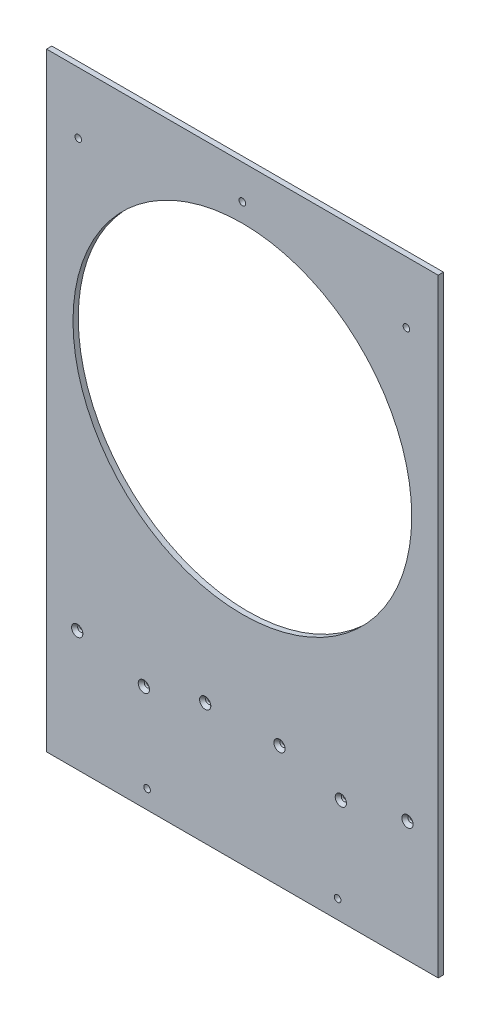
ISO-10303-21;
HEADER;
FILE_DESCRIPTION(('STEP AP214'),'2;1');
FILE_NAME('part.step','',(''),(''),'','','');
FILE_SCHEMA(('AUTOMOTIVE_DESIGN { 1 0 10303 214 1 1 1 1 }'));
ENDSEC;
DATA;
#1=APPLICATION_CONTEXT('core data for automotive mechanical design processes');
#2=APPLICATION_PROTOCOL_DEFINITION('international standard','automotive_design',2000,#1);
#3=PRODUCT_CONTEXT('',#1,'mechanical');
#4=PRODUCT('Part','Part','',(#3));
#5=PRODUCT_RELATED_PRODUCT_CATEGORY('part','',(#4));
#6=PRODUCT_DEFINITION_FORMATION('','',#4);
#7=PRODUCT_DEFINITION_CONTEXT('part definition',#1,'design');
#8=PRODUCT_DEFINITION('design','',#6,#7);
#9=PRODUCT_DEFINITION_SHAPE('','',#8);
#10=(LENGTH_UNIT() NAMED_UNIT(*) SI_UNIT(.MILLI.,.METRE.));
#11=(NAMED_UNIT(*) PLANE_ANGLE_UNIT() SI_UNIT($,.RADIAN.));
#12=(NAMED_UNIT(*) SI_UNIT($,.STERADIAN.) SOLID_ANGLE_UNIT());
#13=UNCERTAINTY_MEASURE_WITH_UNIT(LENGTH_MEASURE(1.E-05),#10,'distance_accuracy_value','');
#14=(GEOMETRIC_REPRESENTATION_CONTEXT(3) GLOBAL_UNCERTAINTY_ASSIGNED_CONTEXT((#13)) GLOBAL_UNIT_ASSIGNED_CONTEXT((#10,
#11,#12)) REPRESENTATION_CONTEXT('',''));
#15=CARTESIAN_POINT('',(0.,0.,0.));
#16=DIRECTION('',(0.,0.,1.));
#17=DIRECTION('',(1.,0.,0.));
#18=AXIS2_PLACEMENT_3D('',#15,#16,#17);
#19=CARTESIAN_POINT('',(0.,0.,6.35));
#20=DIRECTION('',(0.,0.,-1.));
#21=DIRECTION('',(-1.,0.,0.));
#22=AXIS2_PLACEMENT_3D('',#19,#20,#21);
#23=PLANE('',#22);
#24=CARTESIAN_POINT('',(-114.300000000005,1677.035,6.35));
#25=DIRECTION('',(0.,0.,1.));
#26=DIRECTION('',(1.,0.,0.));
#27=AXIS2_PLACEMENT_3D('',#24,#25,#26);
#28=CIRCLE('',#27,3.96874999999999);
#29=CARTESIAN_POINT('',(-110.331250000005,1677.035,6.35));
#30=VERTEX_POINT('',#29);
#31=EDGE_CURVE('E185',#30,#30,#28,.T.);
#32=ORIENTED_EDGE('',*,*,#31,.F.);
#33=EDGE_LOOP('',(#32));
#34=FACE_BOUND('',#33,.T.);
#35=CARTESIAN_POINT('',(114.299999999995,1677.035,6.35));
#36=DIRECTION('',(0.,0.,1.));
#37=DIRECTION('',(1.,0.,0.));
#38=AXIS2_PLACEMENT_3D('',#35,#36,#37);
#39=CIRCLE('',#38,3.96874999999999);
#40=CARTESIAN_POINT('',(118.268749999995,1677.035,6.35));
#41=VERTEX_POINT('',#40);
#42=EDGE_CURVE('E179',#41,#41,#39,.T.);
#43=ORIENTED_EDGE('',*,*,#42,.F.);
#44=EDGE_LOOP('',(#43));
#45=FACE_BOUND('',#44,.T.);
#46=CARTESIAN_POINT('',(-196.850000000007,2311.4,6.35));
#47=DIRECTION('',(0.,0.,1.));
#48=DIRECTION('',(1.,0.,0.));
#49=AXIS2_PLACEMENT_3D('',#46,#47,#48);
#50=CIRCLE('',#49,3.96874999999999);
#51=CARTESIAN_POINT('',(-192.881250000007,2311.4,6.35));
#52=VERTEX_POINT('',#51);
#53=EDGE_CURVE('E173',#52,#52,#50,.T.);
#54=ORIENTED_EDGE('',*,*,#53,.F.);
#55=EDGE_LOOP('',(#54));
#56=FACE_BOUND('',#55,.T.);
#57=CARTESIAN_POINT('',(196.849999999993,2311.4,6.35));
#58=DIRECTION('',(0.,0.,1.));
#59=DIRECTION('',(1.,0.,0.));
#60=AXIS2_PLACEMENT_3D('',#57,#58,#59);
#61=CIRCLE('',#60,3.96874999999999);
#62=CARTESIAN_POINT('',(200.818749999993,2311.4,6.35));
#63=VERTEX_POINT('',#62);
#64=EDGE_CURVE('E167',#63,#63,#61,.T.);
#65=ORIENTED_EDGE('',*,*,#64,.F.);
#66=EDGE_LOOP('',(#65));
#67=FACE_BOUND('',#66,.T.);
#68=CARTESIAN_POINT('',(44.5712711724056,1800.94515264691,6.35));
#69=DIRECTION('',(0.,0.,1.));
#70=DIRECTION('',(1.,0.,0.));
#71=AXIS2_PLACEMENT_3D('',#68,#69,#70);
#72=CIRCLE('',#71,6.7437);
#73=CARTESIAN_POINT('',(51.3149711724056,1800.94515264691,6.35));
#74=VERTEX_POINT('',#73);
#75=EDGE_CURVE('E155',#74,#74,#72,.T.);
#76=ORIENTED_EDGE('',*,*,#75,.F.);
#77=EDGE_LOOP('',(#76));
#78=FACE_BOUND('',#77,.T.);
#79=CARTESIAN_POINT('',(118.174819135633,1781.2231414101,6.35));
#80=DIRECTION('',(0.,0.,1.));
#81=DIRECTION('',(1.,0.,0.));
#82=AXIS2_PLACEMENT_3D('',#79,#80,#81);
#83=CIRCLE('',#82,6.7437);
#84=CARTESIAN_POINT('',(124.918519135633,1781.2231414101,6.35));
#85=VERTEX_POINT('',#84);
#86=EDGE_CURVE('E146',#85,#85,#83,.T.);
#87=ORIENTED_EDGE('',*,*,#86,.F.);
#88=EDGE_LOOP('',(#87));
#89=FACE_BOUND('',#88,.T.);
#90=CARTESIAN_POINT('',(-44.5712711724155,1800.94515264691,6.35));
#91=DIRECTION('',(0.,0.,1.));
#92=DIRECTION('',(1.,0.,0.));
#93=AXIS2_PLACEMENT_3D('',#90,#91,#92);
#94=CIRCLE('',#93,6.7437);
#95=CARTESIAN_POINT('',(-37.8275711724155,1800.94515264691,6.35));
#96=VERTEX_POINT('',#95);
#97=EDGE_CURVE('E137',#96,#96,#94,.T.);
#98=ORIENTED_EDGE('',*,*,#97,.F.);
#99=EDGE_LOOP('',(#98));
#100=FACE_BOUND('',#99,.T.);
#101=CARTESIAN_POINT('',(-118.174819135643,1781.2231414101,6.35));
#102=DIRECTION('',(0.,0.,1.));
#103=DIRECTION('',(1.,0.,0.));
#104=AXIS2_PLACEMENT_3D('',#101,#102,#103);
#105=CIRCLE('',#104,6.7437);
#106=CARTESIAN_POINT('',(-111.431119135643,1781.2231414101,6.35));
#107=VERTEX_POINT('',#106);
#108=EDGE_CURVE('E128',#107,#107,#105,.T.);
#109=ORIENTED_EDGE('',*,*,#108,.F.);
#110=EDGE_LOOP('',(#109));
#111=FACE_BOUND('',#110,.T.);
#112=CARTESIAN_POINT('',(-198.120000000005,1799.24591723236,6.35));
#113=DIRECTION('',(0.,0.,1.));
#114=DIRECTION('',(1.,0.,0.));
#115=AXIS2_PLACEMENT_3D('',#112,#113,#114);
#116=CIRCLE('',#115,6.74369999999999);
#117=CARTESIAN_POINT('',(-191.376300000005,1799.24591723236,6.35));
#118=VERTEX_POINT('',#117);
#119=EDGE_CURVE('E119',#118,#118,#116,.T.);
#120=ORIENTED_EDGE('',*,*,#119,.F.);
#121=EDGE_LOOP('',(#120));
#122=FACE_BOUND('',#121,.T.);
#123=CARTESIAN_POINT('',(198.120000000005,1799.24591723236,6.35));
#124=DIRECTION('',(0.,0.,1.));
#125=DIRECTION('',(1.,0.,0.));
#126=AXIS2_PLACEMENT_3D('',#123,#124,#125);
#127=CIRCLE('',#126,6.74369999999999);
#128=CARTESIAN_POINT('',(204.863700000005,1799.24591723236,6.35));
#129=VERTEX_POINT('',#128);
#130=EDGE_CURVE('E110',#129,#129,#127,.T.);
#131=ORIENTED_EDGE('',*,*,#130,.F.);
#132=EDGE_LOOP('',(#131));
#133=FACE_BOUND('',#132,.T.);
#134=DIRECTION('',(0.,1.,0.));
#135=VECTOR('',#134,1.);
#136=CARTESIAN_POINT('',(234.95,0.,6.35));
#137=LINE('',#136,#135);
#138=CARTESIAN_POINT('',(234.95,1654.81,6.35));
#139=VERTEX_POINT('',#138);
#140=CARTESIAN_POINT('',(234.95,2385.06,6.35));
#141=VERTEX_POINT('',#140);
#142=EDGE_CURVE('E11',#139,#141,#137,.T.);
#143=ORIENTED_EDGE('',*,*,#142,.T.);
#144=DIRECTION('',(1.,0.,0.));
#145=VECTOR('',#144,1.);
#146=CARTESIAN_POINT('',(-234.95,2385.06,6.35));
#147=LINE('',#146,#145);
#148=CARTESIAN_POINT('',(-234.95,2385.06,6.35));
#149=VERTEX_POINT('',#148);
#150=EDGE_CURVE('E51',#149,#141,#147,.T.);
#151=ORIENTED_EDGE('',*,*,#150,.F.);
#152=DIRECTION('',(0.,-1.,0.));
#153=VECTOR('',#152,1.);
#154=CARTESIAN_POINT('',(-234.95,0.,6.35));
#155=LINE('',#154,#153);
#156=CARTESIAN_POINT('',(-234.95,1654.81,6.35));
#157=VERTEX_POINT('',#156);
#158=EDGE_CURVE('E43',#149,#157,#155,.T.);
#159=ORIENTED_EDGE('',*,*,#158,.T.);
#160=DIRECTION('',(-1.,0.,0.));
#161=VECTOR('',#160,1.);
#162=CARTESIAN_POINT('',(-234.95,1654.81,6.35));
#163=LINE('',#162,#161);
#164=EDGE_CURVE('E191',#139,#157,#163,.T.);
#165=ORIENTED_EDGE('',*,*,#164,.F.);
#166=EDGE_LOOP('',(#143,#151,#159,#165));
#167=FACE_BOUND('',#166,.T.);
#168=CARTESIAN_POINT('',(-4.96628305637047E-12,2118.36,6.35));
#169=DIRECTION('',(0.,0.,1.));
#170=DIRECTION('',(1.,0.,0.));
#171=AXIS2_PLACEMENT_3D('',#168,#169,#170);
#172=CIRCLE('',#171,203.2);
#173=CARTESIAN_POINT('',(203.199999999995,2118.36,6.35));
#174=VERTEX_POINT('',#173);
#175=EDGE_CURVE('E95',#174,#174,#172,.T.);
#176=ORIENTED_EDGE('',*,*,#175,.F.);
#177=EDGE_LOOP('',(#176));
#178=FACE_BOUND('',#177,.T.);
#179=CARTESIAN_POINT('',(0.,2343.785,6.35));
#180=DIRECTION('',(0.,0.,1.));
#181=DIRECTION('',(1.,0.,0.));
#182=AXIS2_PLACEMENT_3D('',#179,#180,#181);
#183=CIRCLE('',#182,3.96875);
#184=CARTESIAN_POINT('',(3.96875,2343.785,6.35));
#185=VERTEX_POINT('',#184);
#186=EDGE_CURVE('E161',#185,#185,#183,.T.);
#187=ORIENTED_EDGE('',*,*,#186,.F.);
#188=EDGE_LOOP('',(#187));
#189=FACE_BOUND('',#188,.T.);
#190=ADVANCED_FACE('F34',(#34,#45,#56,#67,#78,#89,#100,#111,#122,#133,#167,#178,#189),#23,.F.);
#191=CARTESIAN_POINT('',(0.,0.,0.));
#192=DIRECTION('',(0.,0.,-1.));
#193=DIRECTION('',(-1.,0.,0.));
#194=AXIS2_PLACEMENT_3D('',#191,#192,#193);
#195=PLANE('',#194);
#196=DIRECTION('',(1.,0.,0.));
#197=VECTOR('',#196,1.);
#198=CARTESIAN_POINT('',(-234.95,2385.06,0.));
#199=LINE('',#198,#197);
#200=CARTESIAN_POINT('',(-234.95,2385.06,0.));
#201=VERTEX_POINT('',#200);
#202=CARTESIAN_POINT('',(234.95,2385.06,0.));
#203=VERTEX_POINT('',#202);
#204=EDGE_CURVE('E78',#201,#203,#199,.T.);
#205=ORIENTED_EDGE('',*,*,#204,.T.);
#206=DIRECTION('',(0.,1.,0.));
#207=VECTOR('',#206,1.);
#208=CARTESIAN_POINT('',(234.95,0.,0.));
#209=LINE('',#208,#207);
#210=CARTESIAN_POINT('',(234.95,1654.81,0.));
#211=VERTEX_POINT('',#210);
#212=EDGE_CURVE('E38',#211,#203,#209,.T.);
#213=ORIENTED_EDGE('',*,*,#212,.F.);
#214=DIRECTION('',(-1.,0.,0.));
#215=VECTOR('',#214,1.);
#216=CARTESIAN_POINT('',(-234.95,1654.81,0.));
#217=LINE('',#216,#215);
#218=CARTESIAN_POINT('',(-234.95,1654.81,0.));
#219=VERTEX_POINT('',#218);
#220=EDGE_CURVE('E59',#211,#219,#217,.T.);
#221=ORIENTED_EDGE('',*,*,#220,.T.);
#222=DIRECTION('',(0.,-1.,0.));
#223=VECTOR('',#222,1.);
#224=CARTESIAN_POINT('',(-234.95,0.,0.));
#225=LINE('',#224,#223);
#226=EDGE_CURVE('E90',#201,#219,#225,.T.);
#227=ORIENTED_EDGE('',*,*,#226,.F.);
#228=EDGE_LOOP('',(#205,#213,#221,#227));
#229=FACE_BOUND('',#228,.T.);
#230=CARTESIAN_POINT('',(-114.300000000005,1677.035,0.));
#231=DIRECTION('',(0.,0.,1.));
#232=DIRECTION('',(1.,0.,0.));
#233=AXIS2_PLACEMENT_3D('',#230,#231,#232);
#234=CIRCLE('',#233,3.96874999999999);
#235=CARTESIAN_POINT('',(-110.331250000005,1677.035,0.));
#236=VERTEX_POINT('',#235);
#237=EDGE_CURVE('E182',#236,#236,#234,.T.);
#238=ORIENTED_EDGE('',*,*,#237,.T.);
#239=EDGE_LOOP('',(#238));
#240=FACE_BOUND('',#239,.T.);
#241=CARTESIAN_POINT('',(114.299999999995,1677.035,0.));
#242=DIRECTION('',(0.,0.,1.));
#243=DIRECTION('',(1.,0.,0.));
#244=AXIS2_PLACEMENT_3D('',#241,#242,#243);
#245=CIRCLE('',#244,3.96874999999999);
#246=CARTESIAN_POINT('',(118.268749999995,1677.035,0.));
#247=VERTEX_POINT('',#246);
#248=EDGE_CURVE('E176',#247,#247,#245,.T.);
#249=ORIENTED_EDGE('',*,*,#248,.T.);
#250=EDGE_LOOP('',(#249));
#251=FACE_BOUND('',#250,.T.);
#252=CARTESIAN_POINT('',(-196.850000000007,2311.4,0.));
#253=DIRECTION('',(0.,0.,1.));
#254=DIRECTION('',(1.,0.,0.));
#255=AXIS2_PLACEMENT_3D('',#252,#253,#254);
#256=CIRCLE('',#255,3.96874999999999);
#257=CARTESIAN_POINT('',(-192.881250000007,2311.4,0.));
#258=VERTEX_POINT('',#257);
#259=EDGE_CURVE('E170',#258,#258,#256,.T.);
#260=ORIENTED_EDGE('',*,*,#259,.T.);
#261=EDGE_LOOP('',(#260));
#262=FACE_BOUND('',#261,.T.);
#263=CARTESIAN_POINT('',(196.849999999993,2311.4,0.));
#264=DIRECTION('',(0.,0.,1.));
#265=DIRECTION('',(1.,0.,0.));
#266=AXIS2_PLACEMENT_3D('',#263,#264,#265);
#267=CIRCLE('',#266,3.96874999999999);
#268=CARTESIAN_POINT('',(200.818749999993,2311.4,0.));
#269=VERTEX_POINT('',#268);
#270=EDGE_CURVE('E164',#269,#269,#267,.T.);
#271=ORIENTED_EDGE('',*,*,#270,.T.);
#272=EDGE_LOOP('',(#271));
#273=FACE_BOUND('',#272,.T.);
#274=CARTESIAN_POINT('',(0.,2343.785,0.));
#275=DIRECTION('',(0.,0.,1.));
#276=DIRECTION('',(1.,0.,0.));
#277=AXIS2_PLACEMENT_3D('',#274,#275,#276);
#278=CIRCLE('',#277,3.96875);
#279=CARTESIAN_POINT('',(3.96875,2343.785,0.));
#280=VERTEX_POINT('',#279);
#281=EDGE_CURVE('E158',#280,#280,#278,.T.);
#282=ORIENTED_EDGE('',*,*,#281,.T.);
#283=EDGE_LOOP('',(#282));
#284=FACE_BOUND('',#283,.T.);
#285=CARTESIAN_POINT('',(-4.96628305637047E-12,2118.36,0.));
#286=DIRECTION('',(0.,0.,1.));
#287=DIRECTION('',(1.,0.,0.));
#288=AXIS2_PLACEMENT_3D('',#285,#286,#287);
#289=CIRCLE('',#288,203.2);
#290=CARTESIAN_POINT('',(203.199999999995,2118.36,0.));
#291=VERTEX_POINT('',#290);
#292=EDGE_CURVE('E99',#291,#291,#289,.T.);
#293=ORIENTED_EDGE('',*,*,#292,.T.);
#294=EDGE_LOOP('',(#293));
#295=FACE_BOUND('',#294,.T.);
#296=CARTESIAN_POINT('',(198.120000000005,1799.24591723236,0.));
#297=DIRECTION('',(0.,0.,1.));
#298=DIRECTION('',(1.,0.,0.));
#299=AXIS2_PLACEMENT_3D('',#296,#297,#298);
#300=CIRCLE('',#299,3.3782);
#301=CARTESIAN_POINT('',(201.498200000005,1799.24591723236,0.));
#302=VERTEX_POINT('',#301);
#303=EDGE_CURVE('E103',#302,#302,#300,.T.);
#304=ORIENTED_EDGE('',*,*,#303,.T.);
#305=EDGE_LOOP('',(#304));
#306=FACE_BOUND('',#305,.T.);
#307=CARTESIAN_POINT('',(-198.120000000005,1799.24591723236,0.));
#308=DIRECTION('',(0.,0.,1.));
#309=DIRECTION('',(1.,0.,0.));
#310=AXIS2_PLACEMENT_3D('',#307,#308,#309);
#311=CIRCLE('',#310,3.3782);
#312=CARTESIAN_POINT('',(-194.741800000005,1799.24591723236,0.));
#313=VERTEX_POINT('',#312);
#314=EDGE_CURVE('E113',#313,#313,#311,.T.);
#315=ORIENTED_EDGE('',*,*,#314,.T.);
#316=EDGE_LOOP('',(#315));
#317=FACE_BOUND('',#316,.T.);
#318=CARTESIAN_POINT('',(-118.174819135643,1781.2231414101,0.));
#319=DIRECTION('',(0.,0.,1.));
#320=DIRECTION('',(1.,0.,0.));
#321=AXIS2_PLACEMENT_3D('',#318,#319,#320);
#322=CIRCLE('',#321,3.37819999999998);
#323=CARTESIAN_POINT('',(-114.796619135643,1781.2231414101,0.));
#324=VERTEX_POINT('',#323);
#325=EDGE_CURVE('E122',#324,#324,#322,.T.);
#326=ORIENTED_EDGE('',*,*,#325,.T.);
#327=EDGE_LOOP('',(#326));
#328=FACE_BOUND('',#327,.T.);
#329=CARTESIAN_POINT('',(-44.5712711724155,1800.94515264691,0.));
#330=DIRECTION('',(0.,0.,1.));
#331=DIRECTION('',(1.,0.,0.));
#332=AXIS2_PLACEMENT_3D('',#329,#330,#331);
#333=CIRCLE('',#332,3.37819999999999);
#334=CARTESIAN_POINT('',(-41.1930711724155,1800.94515264691,0.));
#335=VERTEX_POINT('',#334);
#336=EDGE_CURVE('E131',#335,#335,#333,.T.);
#337=ORIENTED_EDGE('',*,*,#336,.T.);
#338=EDGE_LOOP('',(#337));
#339=FACE_BOUND('',#338,.T.);
#340=CARTESIAN_POINT('',(118.174819135633,1781.2231414101,0.));
#341=DIRECTION('',(0.,0.,1.));
#342=DIRECTION('',(1.,0.,0.));
#343=AXIS2_PLACEMENT_3D('',#340,#341,#342);
#344=CIRCLE('',#343,3.37819999999998);
#345=CARTESIAN_POINT('',(121.553019135633,1781.2231414101,0.));
#346=VERTEX_POINT('',#345);
#347=EDGE_CURVE('E140',#346,#346,#344,.T.);
#348=ORIENTED_EDGE('',*,*,#347,.T.);
#349=EDGE_LOOP('',(#348));
#350=FACE_BOUND('',#349,.T.);
#351=CARTESIAN_POINT('',(44.5712711724056,1800.94515264691,0.));
#352=DIRECTION('',(0.,0.,1.));
#353=DIRECTION('',(1.,0.,0.));
#354=AXIS2_PLACEMENT_3D('',#351,#352,#353);
#355=CIRCLE('',#354,3.37819999999999);
#356=CARTESIAN_POINT('',(47.9494711724056,1800.94515264691,0.));
#357=VERTEX_POINT('',#356);
#358=EDGE_CURVE('E149',#357,#357,#355,.T.);
#359=ORIENTED_EDGE('',*,*,#358,.T.);
#360=EDGE_LOOP('',(#359));
#361=FACE_BOUND('',#360,.T.);
#362=ADVANCED_FACE('F88',(#229,#240,#251,#262,#273,#284,#295,#306,#317,#328,#339,#350,#361),
#195,.T.);
#363=CARTESIAN_POINT('',(-234.95,0.,6.35));
#364=DIRECTION('',(1.,0.,0.));
#365=DIRECTION('',(0.,0.,-1.));
#366=AXIS2_PLACEMENT_3D('',#363,#364,#365);
#367=PLANE('',#366);
#368=ORIENTED_EDGE('',*,*,#158,.F.);
#369=DIRECTION('',(0.,0.,1.));
#370=VECTOR('',#369,1.);
#371=CARTESIAN_POINT('',(-234.95,2385.06,0.));
#372=LINE('',#371,#370);
#373=EDGE_CURVE('E83',#201,#149,#372,.T.);
#374=ORIENTED_EDGE('',*,*,#373,.F.);
#375=ORIENTED_EDGE('',*,*,#226,.T.);
#376=DIRECTION('',(0.,0.,1.));
#377=VECTOR('',#376,1.);
#378=CARTESIAN_POINT('',(-234.95,1654.81,0.));
#379=LINE('',#378,#377);
#380=EDGE_CURVE('E188',#219,#157,#379,.T.);
#381=ORIENTED_EDGE('',*,*,#380,.T.);
#382=EDGE_LOOP('',(#368,#374,#375,#381));
#383=FACE_BOUND('',#382,.T.);
#384=ADVANCED_FACE('F36',(#383),#367,.F.);
#385=CARTESIAN_POINT('',(234.95,0.,6.35));
#386=DIRECTION('',(-1.,0.,0.));
#387=DIRECTION('',(0.,0.,1.));
#388=AXIS2_PLACEMENT_3D('',#385,#386,#387);
#389=PLANE('',#388);
#390=ORIENTED_EDGE('',*,*,#212,.T.);
#391=DIRECTION('',(0.,0.,1.));
#392=VECTOR('',#391,1.);
#393=CARTESIAN_POINT('',(234.95,2385.06,0.));
#394=LINE('',#393,#392);
#395=EDGE_CURVE('E75',#203,#141,#394,.T.);
#396=ORIENTED_EDGE('',*,*,#395,.T.);
#397=ORIENTED_EDGE('',*,*,#142,.F.);
#398=DIRECTION('',(0.,0.,1.));
#399=VECTOR('',#398,1.);
#400=CARTESIAN_POINT('',(234.95,1654.81,0.));
#401=LINE('',#400,#399);
#402=EDGE_CURVE('E93',#211,#139,#401,.T.);
#403=ORIENTED_EDGE('',*,*,#402,.F.);
#404=EDGE_LOOP('',(#390,#396,#397,#403));
#405=FACE_BOUND('',#404,.T.);
#406=ADVANCED_FACE('F92',(#405),#389,.F.);
#407=CARTESIAN_POINT('',(-4.96628305637047E-12,2118.36,6.35));
#408=DIRECTION('',(0.,0.,-1.));
#409=DIRECTION('',(-1.,0.,0.));
#410=AXIS2_PLACEMENT_3D('',#407,#408,#409);
#411=CYLINDRICAL_SURFACE('',#410,203.2);
#412=ORIENTED_EDGE('',*,*,#175,.T.);
#413=EDGE_LOOP('',(#412));
#414=FACE_BOUND('',#413,.T.);
#415=ORIENTED_EDGE('',*,*,#292,.F.);
#416=EDGE_LOOP('',(#415));
#417=FACE_BOUND('',#416,.T.);
#418=ADVANCED_FACE('F222',(#414,#417),#411,.F.);
#419=CARTESIAN_POINT('',(198.120000000005,1799.24591723236,6.35));
#420=DIRECTION('',(0.,0.,1.));
#421=DIRECTION('',(1.,0.,0.));
#422=AXIS2_PLACEMENT_3D('',#419,#420,#421);
#423=CYLINDRICAL_SURFACE('',#422,3.3782);
#424=ORIENTED_EDGE('',*,*,#303,.F.);
#425=EDGE_LOOP('',(#424));
#426=FACE_BOUND('',#425,.T.);
#427=CARTESIAN_POINT('',(198.120000000005,1799.24591723236,2.4784351254977));
#428=DIRECTION('',(0.,0.,1.));
#429=DIRECTION('',(1.,0.,0.));
#430=AXIS2_PLACEMENT_3D('',#427,#428,#429);
#431=CIRCLE('',#430,3.3782);
#432=CARTESIAN_POINT('',(201.498200000005,1799.24591723236,2.4784351254977));
#433=VERTEX_POINT('',#432);
#434=EDGE_CURVE('E107',#433,#433,#431,.T.);
#435=ORIENTED_EDGE('',*,*,#434,.T.);
#436=EDGE_LOOP('',(#435));
#437=FACE_BOUND('',#436,.T.);
#438=ADVANCED_FACE('F229',(#426,#437),#423,.F.);
#439=CARTESIAN_POINT('',(198.120000000005,1799.24591723236,6.35));
#440=DIRECTION('',(0.,0.,1.));
#441=DIRECTION('',(1.,0.,0.));
#442=AXIS2_PLACEMENT_3D('',#439,#440,#441);
#443=CONICAL_SURFACE('',#442,6.74369999999999,0.715584993317675);
#444=ORIENTED_EDGE('',*,*,#434,.F.);
#445=EDGE_LOOP('',(#444));
#446=FACE_BOUND('',#445,.T.);
#447=ORIENTED_EDGE('',*,*,#130,.T.);
#448=EDGE_LOOP('',(#447));
#449=FACE_BOUND('',#448,.T.);
#450=ADVANCED_FACE('F395',(#446,#449),#443,.F.);
#451=CARTESIAN_POINT('',(-198.120000000005,1799.24591723236,6.35));
#452=DIRECTION('',(0.,0.,1.));
#453=DIRECTION('',(1.,0.,0.));
#454=AXIS2_PLACEMENT_3D('',#451,#452,#453);
#455=CYLINDRICAL_SURFACE('',#454,3.3782);
#456=ORIENTED_EDGE('',*,*,#314,.F.);
#457=EDGE_LOOP('',(#456));
#458=FACE_BOUND('',#457,.T.);
#459=CARTESIAN_POINT('',(-198.120000000005,1799.24591723236,2.4784351254977));
#460=DIRECTION('',(0.,0.,1.));
#461=DIRECTION('',(1.,0.,0.));
#462=AXIS2_PLACEMENT_3D('',#459,#460,#461);
#463=CIRCLE('',#462,3.3782);
#464=CARTESIAN_POINT('',(-194.741800000005,1799.24591723236,2.4784351254977));
#465=VERTEX_POINT('',#464);
#466=EDGE_CURVE('E116',#465,#465,#463,.T.);
#467=ORIENTED_EDGE('',*,*,#466,.T.);
#468=EDGE_LOOP('',(#467));
#469=FACE_BOUND('',#468,.T.);
#470=ADVANCED_FACE('F385',(#458,#469),#455,.F.);
#471=CARTESIAN_POINT('',(-198.120000000005,1799.24591723236,6.35));
#472=DIRECTION('',(0.,0.,1.));
#473=DIRECTION('',(1.,0.,0.));
#474=AXIS2_PLACEMENT_3D('',#471,#472,#473);
#475=CONICAL_SURFACE('',#474,6.74369999999999,0.715584993317675);
#476=ORIENTED_EDGE('',*,*,#466,.F.);
#477=EDGE_LOOP('',(#476));
#478=FACE_BOUND('',#477,.T.);
#479=ORIENTED_EDGE('',*,*,#119,.T.);
#480=EDGE_LOOP('',(#479));
#481=FACE_BOUND('',#480,.T.);
#482=ADVANCED_FACE('F375',(#478,#481),#475,.F.);
#483=CARTESIAN_POINT('',(-118.174819135643,1781.2231414101,6.35));
#484=DIRECTION('',(0.,0.,1.));
#485=DIRECTION('',(1.,0.,0.));
#486=AXIS2_PLACEMENT_3D('',#483,#484,#485);
#487=CYLINDRICAL_SURFACE('',#486,3.37819999999999);
#488=ORIENTED_EDGE('',*,*,#325,.F.);
#489=EDGE_LOOP('',(#488));
#490=FACE_BOUND('',#489,.T.);
#491=CARTESIAN_POINT('',(-118.174819135643,1781.2231414101,2.4784351254977));
#492=DIRECTION('',(0.,0.,1.));
#493=DIRECTION('',(1.,0.,0.));
#494=AXIS2_PLACEMENT_3D('',#491,#492,#493);
#495=CIRCLE('',#494,3.3782);
#496=CARTESIAN_POINT('',(-114.796619135643,1781.2231414101,2.4784351254977));
#497=VERTEX_POINT('',#496);
#498=EDGE_CURVE('E125',#497,#497,#495,.T.);
#499=ORIENTED_EDGE('',*,*,#498,.T.);
#500=EDGE_LOOP('',(#499));
#501=FACE_BOUND('',#500,.T.);
#502=ADVANCED_FACE('F365',(#490,#501),#487,.F.);
#503=CARTESIAN_POINT('',(-118.174819135643,1781.2231414101,6.35));
#504=DIRECTION('',(0.,0.,1.));
#505=DIRECTION('',(1.,0.,0.));
#506=AXIS2_PLACEMENT_3D('',#503,#504,#505);
#507=CONICAL_SURFACE('',#506,6.7437,0.715584993317677);
#508=ORIENTED_EDGE('',*,*,#498,.F.);
#509=EDGE_LOOP('',(#508));
#510=FACE_BOUND('',#509,.T.);
#511=ORIENTED_EDGE('',*,*,#108,.T.);
#512=EDGE_LOOP('',(#511));
#513=FACE_BOUND('',#512,.T.);
#514=ADVANCED_FACE('F355',(#510,#513),#507,.F.);
#515=CARTESIAN_POINT('',(-44.5712711724155,1800.94515264691,6.35));
#516=DIRECTION('',(0.,0.,1.));
#517=DIRECTION('',(1.,0.,0.));
#518=AXIS2_PLACEMENT_3D('',#515,#516,#517);
#519=CYLINDRICAL_SURFACE('',#518,3.37819999999999);
#520=ORIENTED_EDGE('',*,*,#336,.F.);
#521=EDGE_LOOP('',(#520));
#522=FACE_BOUND('',#521,.T.);
#523=CARTESIAN_POINT('',(-44.5712711724155,1800.94515264691,2.4784351254977));
#524=DIRECTION('',(0.,0.,1.));
#525=DIRECTION('',(1.,0.,0.));
#526=AXIS2_PLACEMENT_3D('',#523,#524,#525);
#527=CIRCLE('',#526,3.3782);
#528=CARTESIAN_POINT('',(-41.1930711724155,1800.94515264691,2.4784351254977));
#529=VERTEX_POINT('',#528);
#530=EDGE_CURVE('E134',#529,#529,#527,.T.);
#531=ORIENTED_EDGE('',*,*,#530,.T.);
#532=EDGE_LOOP('',(#531));
#533=FACE_BOUND('',#532,.T.);
#534=ADVANCED_FACE('F345',(#522,#533),#519,.F.);
#535=CARTESIAN_POINT('',(-44.5712711724155,1800.94515264691,6.35));
#536=DIRECTION('',(0.,0.,1.));
#537=DIRECTION('',(1.,0.,0.));
#538=AXIS2_PLACEMENT_3D('',#535,#536,#537);
#539=CONICAL_SURFACE('',#538,6.7437,0.715584993317676);
#540=ORIENTED_EDGE('',*,*,#530,.F.);
#541=EDGE_LOOP('',(#540));
#542=FACE_BOUND('',#541,.T.);
#543=ORIENTED_EDGE('',*,*,#97,.T.);
#544=EDGE_LOOP('',(#543));
#545=FACE_BOUND('',#544,.T.);
#546=ADVANCED_FACE('F335',(#542,#545),#539,.F.);
#547=CARTESIAN_POINT('',(118.174819135633,1781.2231414101,6.35));
#548=DIRECTION('',(0.,0.,1.));
#549=DIRECTION('',(1.,0.,0.));
#550=AXIS2_PLACEMENT_3D('',#547,#548,#549);
#551=CYLINDRICAL_SURFACE('',#550,3.37819999999999);
#552=ORIENTED_EDGE('',*,*,#347,.F.);
#553=EDGE_LOOP('',(#552));
#554=FACE_BOUND('',#553,.T.);
#555=CARTESIAN_POINT('',(118.174819135633,1781.2231414101,2.4784351254977));
#556=DIRECTION('',(0.,0.,1.));
#557=DIRECTION('',(1.,0.,0.));
#558=AXIS2_PLACEMENT_3D('',#555,#556,#557);
#559=CIRCLE('',#558,3.3782);
#560=CARTESIAN_POINT('',(121.553019135633,1781.2231414101,2.4784351254977));
#561=VERTEX_POINT('',#560);
#562=EDGE_CURVE('E143',#561,#561,#559,.T.);
#563=ORIENTED_EDGE('',*,*,#562,.T.);
#564=EDGE_LOOP('',(#563));
#565=FACE_BOUND('',#564,.T.);
#566=ADVANCED_FACE('F325',(#554,#565),#551,.F.);
#567=CARTESIAN_POINT('',(118.174819135633,1781.2231414101,6.35));
#568=DIRECTION('',(0.,0.,1.));
#569=DIRECTION('',(1.,0.,0.));
#570=AXIS2_PLACEMENT_3D('',#567,#568,#569);
#571=CONICAL_SURFACE('',#570,6.7437,0.715584993317677);
#572=ORIENTED_EDGE('',*,*,#562,.F.);
#573=EDGE_LOOP('',(#572));
#574=FACE_BOUND('',#573,.T.);
#575=ORIENTED_EDGE('',*,*,#86,.T.);
#576=EDGE_LOOP('',(#575));
#577=FACE_BOUND('',#576,.T.);
#578=ADVANCED_FACE('F315',(#574,#577),#571,.F.);
#579=CARTESIAN_POINT('',(44.5712711724056,1800.94515264691,6.35));
#580=DIRECTION('',(0.,0.,1.));
#581=DIRECTION('',(1.,0.,0.));
#582=AXIS2_PLACEMENT_3D('',#579,#580,#581);
#583=CYLINDRICAL_SURFACE('',#582,3.37819999999999);
#584=ORIENTED_EDGE('',*,*,#358,.F.);
#585=EDGE_LOOP('',(#584));
#586=FACE_BOUND('',#585,.T.);
#587=CARTESIAN_POINT('',(44.5712711724056,1800.94515264691,2.4784351254977));
#588=DIRECTION('',(0.,0.,1.));
#589=DIRECTION('',(1.,0.,0.));
#590=AXIS2_PLACEMENT_3D('',#587,#588,#589);
#591=CIRCLE('',#590,3.3782);
#592=CARTESIAN_POINT('',(47.9494711724056,1800.94515264691,2.4784351254977));
#593=VERTEX_POINT('',#592);
#594=EDGE_CURVE('E152',#593,#593,#591,.T.);
#595=ORIENTED_EDGE('',*,*,#594,.T.);
#596=EDGE_LOOP('',(#595));
#597=FACE_BOUND('',#596,.T.);
#598=ADVANCED_FACE('F305',(#586,#597),#583,.F.);
#599=CARTESIAN_POINT('',(44.5712711724056,1800.94515264691,6.35));
#600=DIRECTION('',(0.,0.,1.));
#601=DIRECTION('',(1.,0.,0.));
#602=AXIS2_PLACEMENT_3D('',#599,#600,#601);
#603=CONICAL_SURFACE('',#602,6.7437,0.715584993317676);
#604=ORIENTED_EDGE('',*,*,#594,.F.);
#605=EDGE_LOOP('',(#604));
#606=FACE_BOUND('',#605,.T.);
#607=ORIENTED_EDGE('',*,*,#75,.T.);
#608=EDGE_LOOP('',(#607));
#609=FACE_BOUND('',#608,.T.);
#610=ADVANCED_FACE('F296',(#606,#609),#603,.F.);
#611=CARTESIAN_POINT('',(0.,2343.785,6.35));
#612=DIRECTION('',(0.,0.,1.));
#613=DIRECTION('',(1.,0.,0.));
#614=AXIS2_PLACEMENT_3D('',#611,#612,#613);
#615=CYLINDRICAL_SURFACE('',#614,3.96875);
#616=ORIENTED_EDGE('',*,*,#281,.F.);
#617=EDGE_LOOP('',(#616));
#618=FACE_BOUND('',#617,.T.);
#619=ORIENTED_EDGE('',*,*,#186,.T.);
#620=EDGE_LOOP('',(#619));
#621=FACE_BOUND('',#620,.T.);
#622=ADVANCED_FACE('F287',(#618,#621),#615,.F.);
#623=CARTESIAN_POINT('',(196.849999999993,2311.4,6.35));
#624=DIRECTION('',(0.,0.,1.));
#625=DIRECTION('',(1.,0.,0.));
#626=AXIS2_PLACEMENT_3D('',#623,#624,#625);
#627=CYLINDRICAL_SURFACE('',#626,3.96874999999999);
#628=ORIENTED_EDGE('',*,*,#270,.F.);
#629=EDGE_LOOP('',(#628));
#630=FACE_BOUND('',#629,.T.);
#631=ORIENTED_EDGE('',*,*,#64,.T.);
#632=EDGE_LOOP('',(#631));
#633=FACE_BOUND('',#632,.T.);
#634=ADVANCED_FACE('F277',(#630,#633),#627,.F.);
#635=CARTESIAN_POINT('',(-196.850000000007,2311.4,6.35));
#636=DIRECTION('',(0.,0.,1.));
#637=DIRECTION('',(1.,0.,0.));
#638=AXIS2_PLACEMENT_3D('',#635,#636,#637);
#639=CYLINDRICAL_SURFACE('',#638,3.96874999999999);
#640=ORIENTED_EDGE('',*,*,#259,.F.);
#641=EDGE_LOOP('',(#640));
#642=FACE_BOUND('',#641,.T.);
#643=ORIENTED_EDGE('',*,*,#53,.T.);
#644=EDGE_LOOP('',(#643));
#645=FACE_BOUND('',#644,.T.);
#646=ADVANCED_FACE('F267',(#642,#645),#639,.F.);
#647=CARTESIAN_POINT('',(114.299999999995,1677.035,6.35));
#648=DIRECTION('',(0.,0.,1.));
#649=DIRECTION('',(1.,0.,0.));
#650=AXIS2_PLACEMENT_3D('',#647,#648,#649);
#651=CYLINDRICAL_SURFACE('',#650,3.96874999999999);
#652=ORIENTED_EDGE('',*,*,#248,.F.);
#653=EDGE_LOOP('',(#652));
#654=FACE_BOUND('',#653,.T.);
#655=ORIENTED_EDGE('',*,*,#42,.T.);
#656=EDGE_LOOP('',(#655));
#657=FACE_BOUND('',#656,.T.);
#658=ADVANCED_FACE('F209',(#654,#657),#651,.F.);
#659=CARTESIAN_POINT('',(-114.300000000005,1677.035,6.35));
#660=DIRECTION('',(0.,0.,1.));
#661=DIRECTION('',(1.,0.,0.));
#662=AXIS2_PLACEMENT_3D('',#659,#660,#661);
#663=CYLINDRICAL_SURFACE('',#662,3.96874999999999);
#664=ORIENTED_EDGE('',*,*,#237,.F.);
#665=EDGE_LOOP('',(#664));
#666=FACE_BOUND('',#665,.T.);
#667=ORIENTED_EDGE('',*,*,#31,.T.);
#668=EDGE_LOOP('',(#667));
#669=FACE_BOUND('',#668,.T.);
#670=ADVANCED_FACE('F202',(#666,#669),#663,.F.);
#671=CARTESIAN_POINT('',(-234.95,1654.81,0.));
#672=DIRECTION('',(0.,1.,0.));
#673=DIRECTION('',(0.,0.,1.));
#674=AXIS2_PLACEMENT_3D('',#671,#672,#673);
#675=PLANE('',#674);
#676=ORIENTED_EDGE('',*,*,#164,.T.);
#677=ORIENTED_EDGE('',*,*,#380,.F.);
#678=ORIENTED_EDGE('',*,*,#220,.F.);
#679=ORIENTED_EDGE('',*,*,#402,.T.);
#680=EDGE_LOOP('',(#676,#677,#678,#679));
#681=FACE_BOUND('',#680,.T.);
#682=ADVANCED_FACE('F200',(#681),#675,.F.);
#683=CARTESIAN_POINT('',(-234.95,2385.06,0.));
#684=DIRECTION('',(0.,-1.,0.));
#685=DIRECTION('',(0.,0.,-1.));
#686=AXIS2_PLACEMENT_3D('',#683,#684,#685);
#687=PLANE('',#686);
#688=ORIENTED_EDGE('',*,*,#150,.T.);
#689=ORIENTED_EDGE('',*,*,#395,.F.);
#690=ORIENTED_EDGE('',*,*,#204,.F.);
#691=ORIENTED_EDGE('',*,*,#373,.T.);
#692=EDGE_LOOP('',(#688,#689,#690,#691));
#693=FACE_BOUND('',#692,.T.);
#694=ADVANCED_FACE('F77',(#693),#687,.F.);
#695=CLOSED_SHELL('',(#190,#362,#384,#406,#418,#438,#450,#470,#482,#502,#514,#534,#546,#566,
#578,#598,#610,#622,#634,#646,#658,#670,#682,#694));
#696=MANIFOLD_SOLID_BREP('B2',#695);
#697=ADVANCED_BREP_SHAPE_REPRESENTATION('',(#18,#696),#14);
#698=SHAPE_DEFINITION_REPRESENTATION(#9,#697);
ENDSEC;
END-ISO-10303-21;
